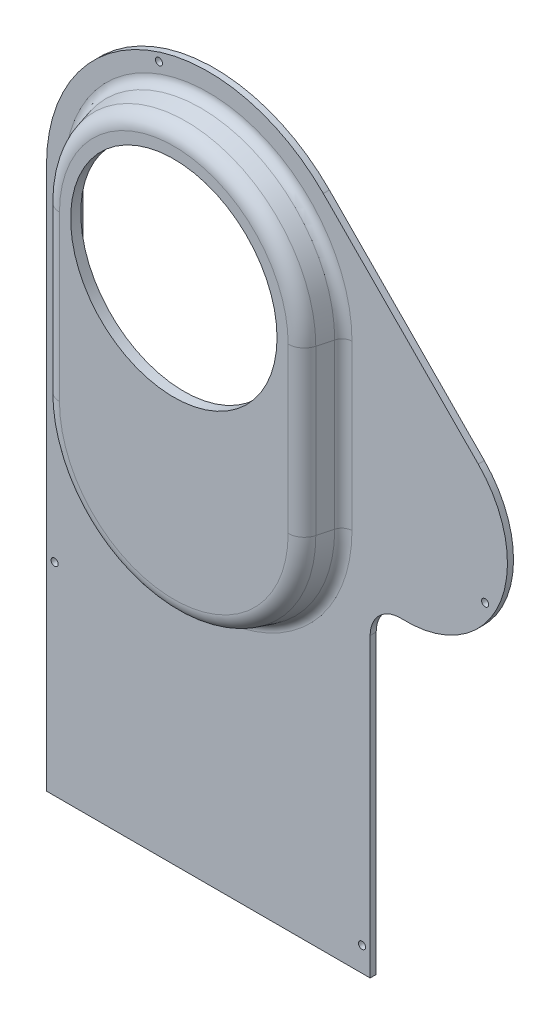
ISO-10303-21;
HEADER;
FILE_DESCRIPTION(('STEP AP214'),'2;1');
FILE_NAME('part.step','',(''),(''),'','','');
FILE_SCHEMA(('AUTOMOTIVE_DESIGN { 1 0 10303 214 1 1 1 1 }'));
ENDSEC;
DATA;
#1=APPLICATION_CONTEXT('core data for automotive mechanical design processes');
#2=APPLICATION_PROTOCOL_DEFINITION('international standard','automotive_design',2000,#1);
#3=PRODUCT_CONTEXT('',#1,'mechanical');
#4=PRODUCT('Part','Part','',(#3));
#5=PRODUCT_RELATED_PRODUCT_CATEGORY('part','',(#4));
#6=PRODUCT_DEFINITION_FORMATION('','',#4);
#7=PRODUCT_DEFINITION_CONTEXT('part definition',#1,'design');
#8=PRODUCT_DEFINITION('design','',#6,#7);
#9=PRODUCT_DEFINITION_SHAPE('','',#8);
#10=(LENGTH_UNIT() NAMED_UNIT(*) SI_UNIT(.MILLI.,.METRE.));
#11=(NAMED_UNIT(*) PLANE_ANGLE_UNIT() SI_UNIT($,.RADIAN.));
#12=(NAMED_UNIT(*) SI_UNIT($,.STERADIAN.) SOLID_ANGLE_UNIT());
#13=UNCERTAINTY_MEASURE_WITH_UNIT(LENGTH_MEASURE(1.E-05),#10,'distance_accuracy_value','');
#14=(GEOMETRIC_REPRESENTATION_CONTEXT(3) GLOBAL_UNCERTAINTY_ASSIGNED_CONTEXT((#13)) GLOBAL_UNIT_ASSIGNED_CONTEXT((#10,
#11,#12)) REPRESENTATION_CONTEXT('',''));
#15=CARTESIAN_POINT('',(0.,0.,0.));
#16=DIRECTION('',(0.,0.,1.));
#17=DIRECTION('',(1.,0.,0.));
#18=AXIS2_PLACEMENT_3D('',#15,#16,#17);
#19=CARTESIAN_POINT('',(10.6567303435174,21.0340968700912,0.));
#20=DIRECTION('',(0.,0.,1.));
#21=DIRECTION('',(1.,0.,0.));
#22=AXIS2_PLACEMENT_3D('',#19,#20,#21);
#23=PLANE('',#22);
#24=CARTESIAN_POINT('',(86.6567303435173,-234.965903129909,0.));
#25=DIRECTION('',(0.,0.,1.));
#26=DIRECTION('',(1.,0.,0.));
#27=AXIS2_PLACEMENT_3D('',#24,#25,#26);
#28=CIRCLE('',#27,1.75);
#29=CARTESIAN_POINT('',(88.4067303435173,-234.965903129909,0.));
#30=VERTEX_POINT('',#29);
#31=EDGE_CURVE('E862',#30,#30,#28,.T.);
#32=ORIENTED_EDGE('',*,*,#31,.T.);
#33=EDGE_LOOP('',(#32));
#34=FACE_BOUND('',#33,.T.);
#35=CARTESIAN_POINT('',(-65.2642696564826,-146.965903129909,0.));
#36=DIRECTION('',(0.,0.,1.));
#37=DIRECTION('',(1.,0.,0.));
#38=AXIS2_PLACEMENT_3D('',#35,#36,#37);
#39=CIRCLE('',#38,1.75);
#40=CARTESIAN_POINT('',(-63.5142696564826,-146.965903129909,0.));
#41=VERTEX_POINT('',#40);
#42=EDGE_CURVE('E856',#41,#41,#39,.T.);
#43=ORIENTED_EDGE('',*,*,#42,.T.);
#44=EDGE_LOOP('',(#43));
#45=FACE_BOUND('',#44,.T.);
#46=CARTESIAN_POINT('',(147.488744141459,-57.965903129909,0.));
#47=DIRECTION('',(0.,0.,1.));
#48=DIRECTION('',(1.,0.,0.));
#49=AXIS2_PLACEMENT_3D('',#46,#47,#48);
#50=CIRCLE('',#49,1.75000000000001);
#51=CARTESIAN_POINT('',(149.238744141459,-57.965903129909,0.));
#52=VERTEX_POINT('',#51);
#53=EDGE_CURVE('E851',#52,#52,#50,.T.);
#54=ORIENTED_EDGE('',*,*,#53,.T.);
#55=EDGE_LOOP('',(#54));
#56=FACE_BOUND('',#55,.T.);
#57=CARTESIAN_POINT('',(-13.6743197776755,93.0340968700912,0.));
#58=DIRECTION('',(0.,0.,1.));
#59=DIRECTION('',(1.,0.,0.));
#60=AXIS2_PLACEMENT_3D('',#57,#58,#59);
#61=CIRCLE('',#60,1.75);
#62=CARTESIAN_POINT('',(-11.9243197776755,93.0340968700912,0.));
#63=VERTEX_POINT('',#62);
#64=EDGE_CURVE('E844',#63,#63,#61,.T.);
#65=ORIENTED_EDGE('',*,*,#64,.T.);
#66=EDGE_LOOP('',(#65));
#67=FACE_BOUND('',#66,.T.);
#68=CARTESIAN_POINT('',(10.6567303435174,21.0340968700912,0.));
#69=DIRECTION('',(0.,0.,1.));
#70=DIRECTION('',(1.,0.,0.));
#71=AXIS2_PLACEMENT_3D('',#68,#69,#70);
#72=CIRCLE('',#71,79.921);
#73=CARTESIAN_POINT('',(67.51781858102,77.1962094144654,0.));
#74=VERTEX_POINT('',#73);
#75=CARTESIAN_POINT('',(-69.2642696564826,21.0340968700912,0.));
#76=VERTEX_POINT('',#75);
#77=EDGE_CURVE('E277',#74,#76,#72,.T.);
#78=ORIENTED_EDGE('',*,*,#77,.F.);
#79=DIRECTION('',(-0.702720343143531,0.711466175817402,0.));
#80=VECTOR('',#79,1.);
#81=CARTESIAN_POINT('',(144.090909762029,-0.329885972732348,0.));
#82=LINE('',#81,#80);
#83=CARTESIAN_POINT('',(144.090909762029,-0.329885972732348,0.));
#84=VERTEX_POINT('',#83);
#85=EDGE_CURVE('E291',#84,#74,#82,.T.);
#86=ORIENTED_EDGE('',*,*,#85,.F.);
#87=CARTESIAN_POINT('',(108.517600971159,-35.4659031299089,0.));
#88=DIRECTION('',(0.,0.,1.));
#89=DIRECTION('',(1.,0.,0.));
#90=AXIS2_PLACEMENT_3D('',#87,#88,#89);
#91=CIRCLE('',#90,50.);
#92=CARTESIAN_POINT('',(106.316931257588,-85.4174501811442,0.));
#93=VERTEX_POINT('',#92);
#94=EDGE_CURVE('E289',#93,#84,#91,.T.);
#95=ORIENTED_EDGE('',*,*,#94,.F.);
#96=CARTESIAN_POINT('',(105.656730343517,-100.402914296515,0.));
#97=DIRECTION('',(0.,0.,-1.));
#98=DIRECTION('',(1.,0.,0.));
#99=AXIS2_PLACEMENT_3D('',#96,#97,#98);
#100=CIRCLE('',#99,15.);
#101=CARTESIAN_POINT('',(90.6567303435173,-100.402914296515,0.));
#102=VERTEX_POINT('',#101);
#103=EDGE_CURVE('E287',#102,#93,#100,.T.);
#104=ORIENTED_EDGE('',*,*,#103,.F.);
#105=DIRECTION('',(0.,1.,0.));
#106=VECTOR('',#105,1.);
#107=CARTESIAN_POINT('',(90.6567303435173,-246.965903129909,0.));
#108=LINE('',#107,#106);
#109=CARTESIAN_POINT('',(90.6567303435173,-246.965903129909,0.));
#110=VERTEX_POINT('',#109);
#111=EDGE_CURVE('E285',#110,#102,#108,.T.);
#112=ORIENTED_EDGE('',*,*,#111,.F.);
#113=DIRECTION('',(1.,0.,0.));
#114=VECTOR('',#113,1.);
#115=CARTESIAN_POINT('',(-69.2642696564826,-246.965903129909,0.));
#116=LINE('',#115,#114);
#117=CARTESIAN_POINT('',(-69.2642696564826,-246.965903129909,0.));
#118=VERTEX_POINT('',#117);
#119=EDGE_CURVE('E283',#118,#110,#116,.T.);
#120=ORIENTED_EDGE('',*,*,#119,.F.);
#121=DIRECTION('',(0.,-1.,0.));
#122=VECTOR('',#121,1.);
#123=CARTESIAN_POINT('',(-69.2642696564826,21.0340968700912,0.));
#124=LINE('',#123,#122);
#125=EDGE_CURVE('E280',#76,#118,#124,.T.);
#126=ORIENTED_EDGE('',*,*,#125,.F.);
#127=EDGE_LOOP('',(#78,#86,#95,#104,#112,#120,#126));
#128=FACE_BOUND('',#127,.T.);
#129=DIRECTION('',(0.,1.,0.));
#130=VECTOR('',#129,1.);
#131=CARTESIAN_POINT('',(-54.3760570190842,21.0340968700912,0.));
#132=LINE('',#131,#130);
#133=CARTESIAN_POINT('',(-54.3760570190842,-59.9659031299088,0.));
#134=VERTEX_POINT('',#133);
#135=CARTESIAN_POINT('',(-54.3760570190842,21.0340968700912,0.));
#136=VERTEX_POINT('',#135);
#137=EDGE_CURVE('E273',#134,#136,#132,.T.);
#138=ORIENTED_EDGE('',*,*,#137,.F.);
#139=CARTESIAN_POINT('',(10.6567303435173,-59.9659031299088,0.));
#140=DIRECTION('',(0.,0.,-1.));
#141=DIRECTION('',(-1.,0.,0.));
#142=AXIS2_PLACEMENT_3D('',#139,#140,#141);
#143=CIRCLE('',#142,65.0327873626014);
#144=CARTESIAN_POINT('',(75.6895177061187,-59.9659031299088,0.));
#145=VERTEX_POINT('',#144);
#146=EDGE_CURVE('E271',#145,#134,#143,.T.);
#147=ORIENTED_EDGE('',*,*,#146,.F.);
#148=DIRECTION('',(0.,-1.,0.));
#149=VECTOR('',#148,1.);
#150=CARTESIAN_POINT('',(75.6895177061187,21.0340968700912,0.));
#151=LINE('',#150,#149);
#152=CARTESIAN_POINT('',(75.6895177061187,21.0340968700912,0.));
#153=VERTEX_POINT('',#152);
#154=EDGE_CURVE('E249',#153,#145,#151,.T.);
#155=ORIENTED_EDGE('',*,*,#154,.F.);
#156=CARTESIAN_POINT('',(10.6567303435173,21.0340968700912,0.));
#157=DIRECTION('',(0.,0.,-1.));
#158=DIRECTION('',(-1.,0.,0.));
#159=AXIS2_PLACEMENT_3D('',#156,#157,#158);
#160=CIRCLE('',#159,65.0327873626014);
#161=EDGE_CURVE('E200',#136,#153,#160,.T.);
#162=ORIENTED_EDGE('',*,*,#161,.F.);
#163=EDGE_LOOP('',(#138,#147,#155,#162));
#164=FACE_BOUND('',#163,.T.);
#165=ADVANCED_FACE('F36',(#34,#45,#56,#67,#128,#164),#23,.F.);
#166=CARTESIAN_POINT('',(10.6567303435174,21.0340968700912,3.));
#167=DIRECTION('',(0.,0.,1.));
#168=DIRECTION('',(1.,0.,0.));
#169=AXIS2_PLACEMENT_3D('',#166,#167,#168);
#170=PLANE('',#169);
#171=CARTESIAN_POINT('',(86.6567303435173,-234.965903129909,3.));
#172=DIRECTION('',(0.,0.,1.));
#173=DIRECTION('',(1.,0.,0.));
#174=AXIS2_PLACEMENT_3D('',#171,#172,#173);
#175=CIRCLE('',#174,1.75);
#176=CARTESIAN_POINT('',(88.4067303435173,-234.965903129909,3.));
#177=VERTEX_POINT('',#176);
#178=EDGE_CURVE('E865',#177,#177,#175,.T.);
#179=ORIENTED_EDGE('',*,*,#178,.F.);
#180=EDGE_LOOP('',(#179));
#181=FACE_BOUND('',#180,.T.);
#182=CARTESIAN_POINT('',(-65.2642696564826,-146.965903129909,3.));
#183=DIRECTION('',(0.,0.,1.));
#184=DIRECTION('',(1.,0.,0.));
#185=AXIS2_PLACEMENT_3D('',#182,#183,#184);
#186=CIRCLE('',#185,1.75);
#187=CARTESIAN_POINT('',(-63.5142696564826,-146.965903129909,3.));
#188=VERTEX_POINT('',#187);
#189=EDGE_CURVE('E859',#188,#188,#186,.T.);
#190=ORIENTED_EDGE('',*,*,#189,.F.);
#191=EDGE_LOOP('',(#190));
#192=FACE_BOUND('',#191,.T.);
#193=CARTESIAN_POINT('',(147.488744141459,-57.965903129909,3.));
#194=DIRECTION('',(0.,0.,1.));
#195=DIRECTION('',(1.,0.,0.));
#196=AXIS2_PLACEMENT_3D('',#193,#194,#195);
#197=CIRCLE('',#196,1.75000000000001);
#198=CARTESIAN_POINT('',(149.238744141459,-57.965903129909,3.));
#199=VERTEX_POINT('',#198);
#200=EDGE_CURVE('E853',#199,#199,#197,.T.);
#201=ORIENTED_EDGE('',*,*,#200,.F.);
#202=EDGE_LOOP('',(#201));
#203=FACE_BOUND('',#202,.T.);
#204=CARTESIAN_POINT('',(-13.6743197776755,93.0340968700912,3.));
#205=DIRECTION('',(0.,0.,1.));
#206=DIRECTION('',(1.,0.,0.));
#207=AXIS2_PLACEMENT_3D('',#204,#205,#206);
#208=CIRCLE('',#207,1.75);
#209=CARTESIAN_POINT('',(-11.9243197776755,93.0340968700912,3.));
#210=VERTEX_POINT('',#209);
#211=EDGE_CURVE('E847',#210,#210,#208,.T.);
#212=ORIENTED_EDGE('',*,*,#211,.F.);
#213=EDGE_LOOP('',(#212));
#214=FACE_BOUND('',#213,.T.);
#215=DIRECTION('',(0.,-1.,0.));
#216=VECTOR('',#215,1.);
#217=CARTESIAN_POINT('',(81.6895177061187,21.0340968700912,3.));
#218=LINE('',#217,#216);
#219=CARTESIAN_POINT('',(81.6895177061187,21.0340968700912,3.));
#220=VERTEX_POINT('',#219);
#221=CARTESIAN_POINT('',(81.6895177061187,-59.9659031299088,3.));
#222=VERTEX_POINT('',#221);
#223=EDGE_CURVE('E344',#220,#222,#218,.T.);
#224=ORIENTED_EDGE('',*,*,#223,.T.);
#225=CARTESIAN_POINT('',(10.6567303435173,-59.9659031299088,3.));
#226=DIRECTION('',(0.,0.,1.));
#227=DIRECTION('',(1.,0.,0.));
#228=AXIS2_PLACEMENT_3D('',#225,#226,#227);
#229=CIRCLE('',#228,71.0327873626015);
#230=CARTESIAN_POINT('',(-60.3760570190841,-59.9659031299088,3.));
#231=VERTEX_POINT('',#230);
#232=EDGE_CURVE('E346',#222,#231,#229,.F.);
#233=ORIENTED_EDGE('',*,*,#232,.T.);
#234=DIRECTION('',(0.,1.,0.));
#235=VECTOR('',#234,1.);
#236=CARTESIAN_POINT('',(-60.3760570190842,21.0340968700912,3.));
#237=LINE('',#236,#235);
#238=CARTESIAN_POINT('',(-60.3760570190842,21.0340968700912,3.));
#239=VERTEX_POINT('',#238);
#240=EDGE_CURVE('E342',#231,#239,#237,.T.);
#241=ORIENTED_EDGE('',*,*,#240,.T.);
#242=CARTESIAN_POINT('',(10.6567303435173,21.0340968700912,3.));
#243=DIRECTION('',(0.,0.,1.));
#244=DIRECTION('',(1.,0.,0.));
#245=AXIS2_PLACEMENT_3D('',#242,#243,#244);
#246=CIRCLE('',#245,71.0327873626014);
#247=EDGE_CURVE('E340',#239,#220,#246,.F.);
#248=ORIENTED_EDGE('',*,*,#247,.T.);
#249=EDGE_LOOP('',(#224,#233,#241,#248));
#250=FACE_BOUND('',#249,.T.);
#251=CARTESIAN_POINT('',(10.6567303435174,21.0340968700912,3.));
#252=DIRECTION('',(0.,0.,1.));
#253=DIRECTION('',(1.,0.,0.));
#254=AXIS2_PLACEMENT_3D('',#251,#252,#253);
#255=CIRCLE('',#254,79.921);
#256=CARTESIAN_POINT('',(67.51781858102,77.1962094144654,3.));
#257=VERTEX_POINT('',#256);
#258=CARTESIAN_POINT('',(-69.2642696564826,21.0340968700912,3.));
#259=VERTEX_POINT('',#258);
#260=EDGE_CURVE('E293',#257,#259,#255,.T.);
#261=ORIENTED_EDGE('',*,*,#260,.T.);
#262=DIRECTION('',(0.,-1.,0.));
#263=VECTOR('',#262,1.);
#264=CARTESIAN_POINT('',(-69.2642696564826,21.0340968700912,3.));
#265=LINE('',#264,#263);
#266=CARTESIAN_POINT('',(-69.2642696564826,-246.965903129909,3.));
#267=VERTEX_POINT('',#266);
#268=EDGE_CURVE('E296',#259,#267,#265,.T.);
#269=ORIENTED_EDGE('',*,*,#268,.T.);
#270=DIRECTION('',(1.,0.,0.));
#271=VECTOR('',#270,1.);
#272=CARTESIAN_POINT('',(-69.2642696564826,-246.965903129909,3.));
#273=LINE('',#272,#271);
#274=CARTESIAN_POINT('',(90.6567303435173,-246.965903129909,3.));
#275=VERTEX_POINT('',#274);
#276=EDGE_CURVE('E298',#267,#275,#273,.T.);
#277=ORIENTED_EDGE('',*,*,#276,.T.);
#278=DIRECTION('',(0.,1.,0.));
#279=VECTOR('',#278,1.);
#280=CARTESIAN_POINT('',(90.6567303435173,-246.965903129909,3.));
#281=LINE('',#280,#279);
#282=CARTESIAN_POINT('',(90.6567303435173,-100.402914296515,3.));
#283=VERTEX_POINT('',#282);
#284=EDGE_CURVE('E300',#275,#283,#281,.T.);
#285=ORIENTED_EDGE('',*,*,#284,.T.);
#286=CARTESIAN_POINT('',(105.656730343517,-100.402914296515,3.));
#287=DIRECTION('',(0.,0.,-1.));
#288=DIRECTION('',(1.,0.,0.));
#289=AXIS2_PLACEMENT_3D('',#286,#287,#288);
#290=CIRCLE('',#289,15.);
#291=CARTESIAN_POINT('',(106.316931257588,-85.4174501811442,3.));
#292=VERTEX_POINT('',#291);
#293=EDGE_CURVE('E302',#283,#292,#290,.T.);
#294=ORIENTED_EDGE('',*,*,#293,.T.);
#295=CARTESIAN_POINT('',(108.517600971159,-35.4659031299089,3.));
#296=DIRECTION('',(0.,0.,1.));
#297=DIRECTION('',(1.,0.,0.));
#298=AXIS2_PLACEMENT_3D('',#295,#296,#297);
#299=CIRCLE('',#298,50.);
#300=CARTESIAN_POINT('',(144.090909762029,-0.329885972732348,3.));
#301=VERTEX_POINT('',#300);
#302=EDGE_CURVE('E304',#292,#301,#299,.T.);
#303=ORIENTED_EDGE('',*,*,#302,.T.);
#304=DIRECTION('',(-0.702720343143531,0.711466175817402,0.));
#305=VECTOR('',#304,1.);
#306=CARTESIAN_POINT('',(144.090909762029,-0.329885972732348,3.));
#307=LINE('',#306,#305);
#308=EDGE_CURVE('E306',#301,#257,#307,.T.);
#309=ORIENTED_EDGE('',*,*,#308,.T.);
#310=EDGE_LOOP('',(#261,#269,#277,#285,#294,#303,#309));
#311=FACE_BOUND('',#310,.T.);
#312=ADVANCED_FACE('F449',(#181,#192,#203,#214,#250,#311),#170,.T.);
#313=CARTESIAN_POINT('',(10.6567303435174,21.0340968700912,3.));
#314=DIRECTION('',(0.,0.,-1.));
#315=DIRECTION('',(-1.,0.,0.));
#316=AXIS2_PLACEMENT_3D('',#313,#314,#315);
#317=CYLINDRICAL_SURFACE('',#316,79.921);
#318=ORIENTED_EDGE('',*,*,#77,.T.);
#319=DIRECTION('',(0.,0.,-1.));
#320=VECTOR('',#319,1.);
#321=CARTESIAN_POINT('',(-69.2642696564826,21.0340968700912,3.));
#322=LINE('',#321,#320);
#323=EDGE_CURVE('E326',#259,#76,#322,.T.);
#324=ORIENTED_EDGE('',*,*,#323,.F.);
#325=ORIENTED_EDGE('',*,*,#260,.F.);
#326=DIRECTION('',(0.,0.,-1.));
#327=VECTOR('',#326,1.);
#328=CARTESIAN_POINT('',(67.51781858102,77.1962094144654,3.));
#329=LINE('',#328,#327);
#330=EDGE_CURVE('E308',#257,#74,#329,.T.);
#331=ORIENTED_EDGE('',*,*,#330,.T.);
#332=EDGE_LOOP('',(#318,#324,#325,#331));
#333=FACE_BOUND('',#332,.T.);
#334=ADVANCED_FACE('F454',(#333),#317,.T.);
#335=CARTESIAN_POINT('',(-69.2642696564826,21.0340968700912,3.));
#336=DIRECTION('',(1.,0.,0.));
#337=DIRECTION('',(0.,1.,0.));
#338=AXIS2_PLACEMENT_3D('',#335,#336,#337);
#339=PLANE('',#338);
#340=ORIENTED_EDGE('',*,*,#125,.T.);
#341=DIRECTION('',(0.,0.,-1.));
#342=VECTOR('',#341,1.);
#343=CARTESIAN_POINT('',(-69.2642696564826,-246.965903129909,3.));
#344=LINE('',#343,#342);
#345=EDGE_CURVE('E323',#267,#118,#344,.T.);
#346=ORIENTED_EDGE('',*,*,#345,.F.);
#347=ORIENTED_EDGE('',*,*,#268,.F.);
#348=ORIENTED_EDGE('',*,*,#323,.T.);
#349=EDGE_LOOP('',(#340,#346,#347,#348));
#350=FACE_BOUND('',#349,.T.);
#351=ADVANCED_FACE('F479',(#350),#339,.F.);
#352=CARTESIAN_POINT('',(-69.2642696564826,-246.965903129909,3.));
#353=DIRECTION('',(0.,1.,0.));
#354=DIRECTION('',(0.,0.,1.));
#355=AXIS2_PLACEMENT_3D('',#352,#353,#354);
#356=PLANE('',#355);
#357=ORIENTED_EDGE('',*,*,#119,.T.);
#358=DIRECTION('',(0.,0.,-1.));
#359=VECTOR('',#358,1.);
#360=CARTESIAN_POINT('',(90.6567303435173,-246.965903129909,3.));
#361=LINE('',#360,#359);
#362=EDGE_CURVE('E320',#275,#110,#361,.T.);
#363=ORIENTED_EDGE('',*,*,#362,.F.);
#364=ORIENTED_EDGE('',*,*,#276,.F.);
#365=ORIENTED_EDGE('',*,*,#345,.T.);
#366=EDGE_LOOP('',(#357,#363,#364,#365));
#367=FACE_BOUND('',#366,.T.);
#368=ADVANCED_FACE('F475',(#367),#356,.F.);
#369=CARTESIAN_POINT('',(90.6567303435173,-246.965903129909,3.));
#370=DIRECTION('',(-1.,0.,0.));
#371=DIRECTION('',(0.,0.,1.));
#372=AXIS2_PLACEMENT_3D('',#369,#370,#371);
#373=PLANE('',#372);
#374=ORIENTED_EDGE('',*,*,#111,.T.);
#375=DIRECTION('',(0.,0.,-1.));
#376=VECTOR('',#375,1.);
#377=CARTESIAN_POINT('',(90.6567303435173,-100.402914296515,3.));
#378=LINE('',#377,#376);
#379=EDGE_CURVE('E317',#283,#102,#378,.T.);
#380=ORIENTED_EDGE('',*,*,#379,.F.);
#381=ORIENTED_EDGE('',*,*,#284,.F.);
#382=ORIENTED_EDGE('',*,*,#362,.T.);
#383=EDGE_LOOP('',(#374,#380,#381,#382));
#384=FACE_BOUND('',#383,.T.);
#385=ADVANCED_FACE('F471',(#384),#373,.F.);
#386=CARTESIAN_POINT('',(105.656730343517,-100.402914296515,3.));
#387=DIRECTION('',(0.,0.,-1.));
#388=DIRECTION('',(-1.,0.,0.));
#389=AXIS2_PLACEMENT_3D('',#386,#387,#388);
#390=CYLINDRICAL_SURFACE('',#389,15.);
#391=ORIENTED_EDGE('',*,*,#103,.T.);
#392=DIRECTION('',(0.,0.,-1.));
#393=VECTOR('',#392,1.);
#394=CARTESIAN_POINT('',(106.316931257588,-85.4174501811442,3.));
#395=LINE('',#394,#393);
#396=EDGE_CURVE('E314',#292,#93,#395,.T.);
#397=ORIENTED_EDGE('',*,*,#396,.F.);
#398=ORIENTED_EDGE('',*,*,#293,.F.);
#399=ORIENTED_EDGE('',*,*,#379,.T.);
#400=EDGE_LOOP('',(#391,#397,#398,#399));
#401=FACE_BOUND('',#400,.T.);
#402=ADVANCED_FACE('F467',(#401),#390,.F.);
#403=CARTESIAN_POINT('',(108.517600971159,-35.4659031299089,3.));
#404=DIRECTION('',(0.,0.,-1.));
#405=DIRECTION('',(-1.,0.,0.));
#406=AXIS2_PLACEMENT_3D('',#403,#404,#405);
#407=CYLINDRICAL_SURFACE('',#406,50.);
#408=ORIENTED_EDGE('',*,*,#94,.T.);
#409=DIRECTION('',(0.,0.,-1.));
#410=VECTOR('',#409,1.);
#411=CARTESIAN_POINT('',(144.090909762029,-0.329885972732348,3.));
#412=LINE('',#411,#410);
#413=EDGE_CURVE('E311',#301,#84,#412,.T.);
#414=ORIENTED_EDGE('',*,*,#413,.F.);
#415=ORIENTED_EDGE('',*,*,#302,.F.);
#416=ORIENTED_EDGE('',*,*,#396,.T.);
#417=EDGE_LOOP('',(#408,#414,#415,#416));
#418=FACE_BOUND('',#417,.T.);
#419=ADVANCED_FACE('F463',(#418),#407,.T.);
#420=CARTESIAN_POINT('',(144.090909762029,-0.329885972732348,3.));
#421=DIRECTION('',(-0.711466175817402,-0.702720343143531,0.));
#422=DIRECTION('',(0.702720343143531,-0.711466175817402,0.));
#423=AXIS2_PLACEMENT_3D('',#420,#421,#422);
#424=PLANE('',#423);
#425=ORIENTED_EDGE('',*,*,#85,.T.);
#426=ORIENTED_EDGE('',*,*,#330,.F.);
#427=ORIENTED_EDGE('',*,*,#308,.F.);
#428=ORIENTED_EDGE('',*,*,#413,.T.);
#429=EDGE_LOOP('',(#425,#426,#427,#428));
#430=FACE_BOUND('',#429,.T.);
#431=ADVANCED_FACE('F460',(#430),#424,.F.);
#432=CARTESIAN_POINT('',(10.6567303435173,-59.9659031299088,0.));
#433=DIRECTION('',(0.,0.,-1.));
#434=DIRECTION('',(1.,0.,0.));
#435=AXIS2_PLACEMENT_3D('',#432,#433,#434);
#436=CONICAL_SURFACE('',#435,68.,0.26179938779915);
#437=DIRECTION('',(0.258819045102521,0.,-0.965925826289068));
#438=VECTOR('',#437,1.);
#439=CARTESIAN_POINT('',(78.6567303435173,-59.9659031299088,0.));
#440=LINE('',#439,#438);
#441=CARTESIAN_POINT('',(74.8865372013757,-59.9659031299088,14.0705523608202));
#442=VERTEX_POINT('',#441);
#443=CARTESIAN_POINT('',(76.8598885746734,-59.9659031299088,6.70590477448739));
#444=VERTEX_POINT('',#443);
#445=EDGE_CURVE('E281',#442,#444,#440,.T.);
#446=ORIENTED_EDGE('',*,*,#445,.F.);
#447=CARTESIAN_POINT('',(10.6567303435173,-59.9659031299088,14.0705523608202));
#448=DIRECTION('',(0.,0.,-1.));
#449=DIRECTION('',(-1.,0.,0.));
#450=AXIS2_PLACEMENT_3D('',#447,#448,#449);
#451=CIRCLE('',#450,64.2298068578584);
#452=CARTESIAN_POINT('',(-53.5730765143411,-59.9659031299088,14.0705523608202));
#453=VERTEX_POINT('',#452);
#454=EDGE_CURVE('E45',#442,#453,#451,.T.);
#455=ORIENTED_EDGE('',*,*,#454,.T.);
#456=DIRECTION('',(-0.258819045102521,0.,-0.965925826289068));
#457=VECTOR('',#456,1.);
#458=CARTESIAN_POINT('',(-57.3432696564827,-59.9659031299088,0.));
#459=LINE('',#458,#457);
#460=CARTESIAN_POINT('',(-55.5464278876388,-59.9659031299088,6.7059047744874));
#461=VERTEX_POINT('',#460);
#462=EDGE_CURVE('E330',#453,#461,#459,.T.);
#463=ORIENTED_EDGE('',*,*,#462,.T.);
#464=CARTESIAN_POINT('',(10.6567303435173,-59.9659031299088,6.70590477448746));
#465=DIRECTION('',(0.,0.,1.));
#466=DIRECTION('',(1.,0.,0.));
#467=AXIS2_PLACEMENT_3D('',#464,#465,#466);
#468=CIRCLE('',#467,66.2031582311561);
#469=EDGE_CURVE('E329',#461,#444,#468,.T.);
#470=ORIENTED_EDGE('',*,*,#469,.T.);
#471=EDGE_LOOP('',(#446,#455,#463,#470));
#472=FACE_BOUND('',#471,.T.);
#473=ADVANCED_FACE('F423',(#472),#436,.T.);
#474=CARTESIAN_POINT('',(78.6567303435172,21.0340968700912,0.));
#475=DIRECTION('',(0.965925826289068,0.,0.258819045102521));
#476=DIRECTION('',(0.258819045102521,0.,-0.965925826289068));
#477=AXIS2_PLACEMENT_3D('',#474,#475,#476);
#478=PLANE('',#477);
#479=DIRECTION('',(0.258819045102521,0.,-0.965925826289068));
#480=VECTOR('',#479,1.);
#481=CARTESIAN_POINT('',(78.6567303435173,21.0340968700912,0.));
#482=LINE('',#481,#480);
#483=CARTESIAN_POINT('',(74.8865372013757,21.0340968700912,14.0705523608202));
#484=VERTEX_POINT('',#483);
#485=CARTESIAN_POINT('',(76.8598885746733,21.0340968700912,6.70590477448739));
#486=VERTEX_POINT('',#485);
#487=EDGE_CURVE('E335',#484,#486,#482,.T.);
#488=ORIENTED_EDGE('',*,*,#487,.F.);
#489=DIRECTION('',(0.,1.,0.));
#490=VECTOR('',#489,1.);
#491=CARTESIAN_POINT('',(74.8865372013757,-59.9659031299088,14.0705523608202));
#492=LINE('',#491,#490);
#493=EDGE_CURVE('E378',#484,#442,#492,.F.);
#494=ORIENTED_EDGE('',*,*,#493,.T.);
#495=ORIENTED_EDGE('',*,*,#445,.T.);
#496=DIRECTION('',(0.,1.,0.));
#497=VECTOR('',#496,1.);
#498=CARTESIAN_POINT('',(76.8598885746733,21.0340968700912,6.70590477448739));
#499=LINE('',#498,#497);
#500=EDGE_CURVE('E349',#444,#486,#499,.T.);
#501=ORIENTED_EDGE('',*,*,#500,.T.);
#502=EDGE_LOOP('',(#488,#494,#495,#501));
#503=FACE_BOUND('',#502,.T.);
#504=ADVANCED_FACE('F425',(#503),#478,.T.);
#505=CARTESIAN_POINT('',(10.6567303435173,21.0340968700912,0.));
#506=DIRECTION('',(0.,0.,-1.));
#507=DIRECTION('',(1.,0.,0.));
#508=AXIS2_PLACEMENT_3D('',#505,#506,#507);
#509=CONICAL_SURFACE('',#508,68.,0.26179938779915);
#510=DIRECTION('',(-0.258819045102521,0.,-0.965925826289068));
#511=VECTOR('',#510,1.);
#512=CARTESIAN_POINT('',(-57.3432696564827,21.0340968700912,0.));
#513=LINE('',#512,#511);
#514=CARTESIAN_POINT('',(-53.5730765143411,21.0340968700912,14.0705523608202));
#515=VERTEX_POINT('',#514);
#516=CARTESIAN_POINT('',(-55.5464278876388,21.0340968700912,6.70590477448739));
#517=VERTEX_POINT('',#516);
#518=EDGE_CURVE('E332',#515,#517,#513,.T.);
#519=ORIENTED_EDGE('',*,*,#518,.F.);
#520=CARTESIAN_POINT('',(10.6567303435173,21.0340968700912,14.0705523608202));
#521=DIRECTION('',(0.,0.,-1.));
#522=DIRECTION('',(-1.,0.,0.));
#523=AXIS2_PLACEMENT_3D('',#520,#521,#522);
#524=CIRCLE('',#523,64.2298068578584);
#525=EDGE_CURVE('E381',#515,#484,#524,.T.);
#526=ORIENTED_EDGE('',*,*,#525,.T.);
#527=ORIENTED_EDGE('',*,*,#487,.T.);
#528=CARTESIAN_POINT('',(10.6567303435173,21.0340968700912,6.70590477448743));
#529=DIRECTION('',(0.,0.,1.));
#530=DIRECTION('',(1.,0.,0.));
#531=AXIS2_PLACEMENT_3D('',#528,#529,#530);
#532=CIRCLE('',#531,66.2031582311561);
#533=EDGE_CURVE('E355',#486,#517,#532,.T.);
#534=ORIENTED_EDGE('',*,*,#533,.T.);
#535=EDGE_LOOP('',(#519,#526,#527,#534));
#536=FACE_BOUND('',#535,.T.);
#537=ADVANCED_FACE('F404',(#536),#509,.T.);
#538=CARTESIAN_POINT('',(-57.3432696564827,21.0340968700912,0.));
#539=DIRECTION('',(-0.965925826289068,0.,0.258819045102521));
#540=DIRECTION('',(0.258819045102521,0.,0.965925826289068));
#541=AXIS2_PLACEMENT_3D('',#538,#539,#540);
#542=PLANE('',#541);
#543=ORIENTED_EDGE('',*,*,#462,.F.);
#544=DIRECTION('',(0.,-1.,0.));
#545=VECTOR('',#544,1.);
#546=CARTESIAN_POINT('',(-53.5730765143411,21.0340968700912,14.0705523608202));
#547=LINE('',#546,#545);
#548=EDGE_CURVE('E11',#453,#515,#547,.F.);
#549=ORIENTED_EDGE('',*,*,#548,.T.);
#550=ORIENTED_EDGE('',*,*,#518,.T.);
#551=DIRECTION('',(0.,-1.,0.));
#552=VECTOR('',#551,1.);
#553=CARTESIAN_POINT('',(-55.5464278876388,21.0340968700912,6.70590477448739));
#554=LINE('',#553,#552);
#555=EDGE_CURVE('E352',#517,#461,#554,.T.);
#556=ORIENTED_EDGE('',*,*,#555,.T.);
#557=EDGE_LOOP('',(#543,#549,#550,#556));
#558=FACE_BOUND('',#557,.T.);
#559=ADVANCED_FACE('F402',(#558),#542,.T.);
#560=CARTESIAN_POINT('',(10.6567303435173,-59.9659031299088,20.));
#561=DIRECTION('',(0.,0.,1.));
#562=DIRECTION('',(1.,0.,0.));
#563=AXIS2_PLACEMENT_3D('',#560,#561,#562);
#564=PLANE('',#563);
#565=CARTESIAN_POINT('',(10.6567303435173,21.0340968700912,20.));
#566=DIRECTION('',(0.,0.,1.));
#567=DIRECTION('',(1.,0.,0.));
#568=AXIS2_PLACEMENT_3D('',#565,#566,#567);
#569=CIRCLE('',#568,51.);
#570=CARTESIAN_POINT('',(61.6567303435172,21.0340968700912,20.));
#571=VERTEX_POINT('',#570);
#572=EDGE_CURVE('E842',#571,#571,#569,.T.);
#573=ORIENTED_EDGE('',*,*,#572,.F.);
#574=EDGE_LOOP('',(#573));
#575=FACE_BOUND('',#574,.T.);
#576=CARTESIAN_POINT('',(10.6567303435173,-59.9659031299088,20.));
#577=DIRECTION('',(0.,0.,1.));
#578=DIRECTION('',(1.,0.,0.));
#579=AXIS2_PLACEMENT_3D('',#576,#577,#578);
#580=CIRCLE('',#579,56.5024002475459);
#581=CARTESIAN_POINT('',(-45.8456699040286,-59.9659031299088,20.));
#582=VERTEX_POINT('',#581);
#583=CARTESIAN_POINT('',(67.1591305910631,-59.9659031299088,20.));
#584=VERTEX_POINT('',#583);
#585=EDGE_CURVE('E371',#582,#584,#580,.T.);
#586=ORIENTED_EDGE('',*,*,#585,.T.);
#587=DIRECTION('',(0.,-1.,0.));
#588=VECTOR('',#587,1.);
#589=CARTESIAN_POINT('',(67.1591305910631,21.0340968700912,20.));
#590=LINE('',#589,#588);
#591=CARTESIAN_POINT('',(67.1591305910631,21.0340968700912,20.));
#592=VERTEX_POINT('',#591);
#593=EDGE_CURVE('E375',#584,#592,#590,.F.);
#594=ORIENTED_EDGE('',*,*,#593,.T.);
#595=CARTESIAN_POINT('',(10.6567303435173,21.0340968700912,20.));
#596=DIRECTION('',(0.,0.,1.));
#597=DIRECTION('',(1.,0.,0.));
#598=AXIS2_PLACEMENT_3D('',#595,#596,#597);
#599=CIRCLE('',#598,56.5024002475458);
#600=CARTESIAN_POINT('',(-45.8456699040286,21.0340968700912,20.));
#601=VERTEX_POINT('',#600);
#602=EDGE_CURVE('E373',#592,#601,#599,.T.);
#603=ORIENTED_EDGE('',*,*,#602,.T.);
#604=DIRECTION('',(0.,1.,0.));
#605=VECTOR('',#604,1.);
#606=CARTESIAN_POINT('',(-45.8456699040286,-59.9659031299088,20.));
#607=LINE('',#606,#605);
#608=EDGE_CURVE('E358',#601,#582,#607,.F.);
#609=ORIENTED_EDGE('',*,*,#608,.T.);
#610=EDGE_LOOP('',(#586,#594,#603,#609));
#611=FACE_BOUND('',#610,.T.);
#612=ADVANCED_FACE('F435',(#575,#611),#564,.T.);
#613=CARTESIAN_POINT('',(10.6567303435173,21.0340968700912,8.));
#614=DIRECTION('',(0.,0.,1.));
#615=DIRECTION('',(1.,0.,0.));
#616=AXIS2_PLACEMENT_3D('',#613,#614,#615);
#617=TOROIDAL_SURFACE('',#616,71.0327873626014,5.);
#618=CARTESIAN_POINT('',(81.6895177061187,21.0340968700912,8.));
#619=DIRECTION('',(0.,1.,0.));
#620=DIRECTION('',(-1.,0.,0.));
#621=AXIS2_PLACEMENT_3D('',#618,#619,#620);
#622=CIRCLE('',#621,5.);
#623=EDGE_CURVE('E365',#220,#486,#622,.T.);
#624=ORIENTED_EDGE('',*,*,#623,.F.);
#625=ORIENTED_EDGE('',*,*,#247,.F.);
#626=CARTESIAN_POINT('',(-60.3760570190842,21.0340968700912,8.));
#627=DIRECTION('',(0.,1.,0.));
#628=DIRECTION('',(0.,0.,1.));
#629=AXIS2_PLACEMENT_3D('',#626,#627,#628);
#630=CIRCLE('',#629,5.);
#631=EDGE_CURVE('E333',#517,#239,#630,.T.);
#632=ORIENTED_EDGE('',*,*,#631,.F.);
#633=ORIENTED_EDGE('',*,*,#533,.F.);
#634=EDGE_LOOP('',(#624,#625,#632,#633));
#635=FACE_BOUND('',#634,.T.);
#636=ADVANCED_FACE('F412',(#635),#617,.F.);
#637=CARTESIAN_POINT('',(-60.3760570190842,21.0340968700912,8.));
#638=DIRECTION('',(0.,1.,0.));
#639=DIRECTION('',(-1.,0.,0.));
#640=AXIS2_PLACEMENT_3D('',#637,#638,#639);
#641=CYLINDRICAL_SURFACE('',#640,5.);
#642=ORIENTED_EDGE('',*,*,#631,.T.);
#643=ORIENTED_EDGE('',*,*,#240,.F.);
#644=CARTESIAN_POINT('',(-60.3760570190841,-59.9659031299088,8.));
#645=DIRECTION('',(0.,1.,0.));
#646=DIRECTION('',(0.,0.,1.));
#647=AXIS2_PLACEMENT_3D('',#644,#645,#646);
#648=CIRCLE('',#647,5.);
#649=EDGE_CURVE('E362',#461,#231,#648,.T.);
#650=ORIENTED_EDGE('',*,*,#649,.F.);
#651=ORIENTED_EDGE('',*,*,#555,.F.);
#652=EDGE_LOOP('',(#642,#643,#650,#651));
#653=FACE_BOUND('',#652,.T.);
#654=ADVANCED_FACE('F416',(#653),#641,.F.);
#655=CARTESIAN_POINT('',(81.6895177061187,21.0340968700912,8.));
#656=DIRECTION('',(0.,-1.,0.));
#657=DIRECTION('',(1.,0.,0.));
#658=AXIS2_PLACEMENT_3D('',#655,#656,#657);
#659=CYLINDRICAL_SURFACE('',#658,5.);
#660=ORIENTED_EDGE('',*,*,#623,.T.);
#661=ORIENTED_EDGE('',*,*,#500,.F.);
#662=CARTESIAN_POINT('',(81.6895177061187,-59.9659031299088,8.));
#663=DIRECTION('',(0.,1.,0.));
#664=DIRECTION('',(0.,0.,1.));
#665=AXIS2_PLACEMENT_3D('',#662,#663,#664);
#666=CIRCLE('',#665,5.);
#667=EDGE_CURVE('E359',#222,#444,#666,.T.);
#668=ORIENTED_EDGE('',*,*,#667,.F.);
#669=ORIENTED_EDGE('',*,*,#223,.F.);
#670=EDGE_LOOP('',(#660,#661,#668,#669));
#671=FACE_BOUND('',#670,.T.);
#672=ADVANCED_FACE('F495',(#671),#659,.F.);
#673=CARTESIAN_POINT('',(10.6567303435173,-59.9659031299088,8.));
#674=DIRECTION('',(0.,0.,1.));
#675=DIRECTION('',(1.,0.,0.));
#676=AXIS2_PLACEMENT_3D('',#673,#674,#675);
#677=TOROIDAL_SURFACE('',#676,71.0327873626015,5.);
#678=ORIENTED_EDGE('',*,*,#649,.T.);
#679=ORIENTED_EDGE('',*,*,#232,.F.);
#680=ORIENTED_EDGE('',*,*,#667,.T.);
#681=ORIENTED_EDGE('',*,*,#469,.F.);
#682=EDGE_LOOP('',(#678,#679,#680,#681));
#683=FACE_BOUND('',#682,.T.);
#684=ADVANCED_FACE('F420',(#683),#677,.F.);
#685=CARTESIAN_POINT('',(-45.8456699040286,-59.9659031299088,12.));
#686=DIRECTION('',(0.,-1.,0.));
#687=DIRECTION('',(1.,0.,0.));
#688=AXIS2_PLACEMENT_3D('',#685,#686,#687);
#689=CYLINDRICAL_SURFACE('',#688,8.);
#690=CARTESIAN_POINT('',(-45.8456699040286,21.0340968700912,12.));
#691=DIRECTION('',(0.,1.,0.));
#692=DIRECTION('',(0.,0.,1.));
#693=AXIS2_PLACEMENT_3D('',#690,#691,#692);
#694=CIRCLE('',#693,8.);
#695=EDGE_CURVE('E387',#515,#601,#694,.T.);
#696=ORIENTED_EDGE('',*,*,#695,.F.);
#697=ORIENTED_EDGE('',*,*,#548,.F.);
#698=CARTESIAN_POINT('',(-45.8456699040286,-59.9659031299088,12.));
#699=DIRECTION('',(0.,-1.,0.));
#700=DIRECTION('',(0.,0.,-1.));
#701=AXIS2_PLACEMENT_3D('',#698,#699,#700);
#702=CIRCLE('',#701,8.);
#703=EDGE_CURVE('E363',#582,#453,#702,.T.);
#704=ORIENTED_EDGE('',*,*,#703,.F.);
#705=ORIENTED_EDGE('',*,*,#608,.F.);
#706=EDGE_LOOP('',(#696,#697,#704,#705));
#707=FACE_BOUND('',#706,.T.);
#708=ADVANCED_FACE('F38',(#707),#689,.T.);
#709=CARTESIAN_POINT('',(10.6567303435173,-59.9659031299088,12.));
#710=DIRECTION('',(0.,0.,1.));
#711=DIRECTION('',(1.,0.,0.));
#712=AXIS2_PLACEMENT_3D('',#709,#710,#711);
#713=TOROIDAL_SURFACE('',#712,56.5024002475459,8.);
#714=ORIENTED_EDGE('',*,*,#703,.T.);
#715=ORIENTED_EDGE('',*,*,#454,.F.);
#716=CARTESIAN_POINT('',(67.1591305910631,-59.9659031299088,12.));
#717=DIRECTION('',(0.,1.,0.));
#718=DIRECTION('',(-1.,0.,0.));
#719=AXIS2_PLACEMENT_3D('',#716,#717,#718);
#720=CIRCLE('',#719,8.);
#721=EDGE_CURVE('E385',#584,#442,#720,.T.);
#722=ORIENTED_EDGE('',*,*,#721,.F.);
#723=ORIENTED_EDGE('',*,*,#585,.F.);
#724=EDGE_LOOP('',(#714,#715,#722,#723));
#725=FACE_BOUND('',#724,.T.);
#726=ADVANCED_FACE('F393',(#725),#713,.T.);
#727=CARTESIAN_POINT('',(10.6567303435173,21.0340968700912,12.));
#728=DIRECTION('',(0.,0.,1.));
#729=DIRECTION('',(1.,0.,0.));
#730=AXIS2_PLACEMENT_3D('',#727,#728,#729);
#731=TOROIDAL_SURFACE('',#730,56.5024002475458,8.);
#732=ORIENTED_EDGE('',*,*,#695,.T.);
#733=ORIENTED_EDGE('',*,*,#602,.F.);
#734=CARTESIAN_POINT('',(67.1591305910631,21.0340968700912,12.));
#735=DIRECTION('',(0.,-1.,0.));
#736=DIRECTION('',(0.,0.,-1.));
#737=AXIS2_PLACEMENT_3D('',#734,#735,#736);
#738=CIRCLE('',#737,8.);
#739=EDGE_CURVE('E276',#484,#592,#738,.T.);
#740=ORIENTED_EDGE('',*,*,#739,.F.);
#741=ORIENTED_EDGE('',*,*,#525,.F.);
#742=EDGE_LOOP('',(#732,#733,#740,#741));
#743=FACE_BOUND('',#742,.T.);
#744=ADVANCED_FACE('F433',(#743),#731,.T.);
#745=CARTESIAN_POINT('',(67.1591305910631,-59.9659031299088,12.));
#746=DIRECTION('',(0.,1.,0.));
#747=DIRECTION('',(-1.,0.,0.));
#748=AXIS2_PLACEMENT_3D('',#745,#746,#747);
#749=CYLINDRICAL_SURFACE('',#748,8.);
#750=ORIENTED_EDGE('',*,*,#721,.T.);
#751=ORIENTED_EDGE('',*,*,#493,.F.);
#752=ORIENTED_EDGE('',*,*,#739,.T.);
#753=ORIENTED_EDGE('',*,*,#593,.F.);
#754=EDGE_LOOP('',(#750,#751,#752,#753));
#755=FACE_BOUND('',#754,.T.);
#756=ADVANCED_FACE('F429',(#755),#749,.T.);
#757=CARTESIAN_POINT('',(10.6567303435173,-59.9659031299088,-1.29409522551261));
#758=DIRECTION('',(0.,0.,-1.));
#759=DIRECTION('',(1.,0.,0.));
#760=AXIS2_PLACEMENT_3D('',#757,#758,#759);
#761=CONICAL_SURFACE('',#760,63.1703708685547,0.26179938779915);
#762=DIRECTION('',(0.258819045102521,0.,-0.965925826289068));
#763=VECTOR('',#762,1.);
#764=CARTESIAN_POINT('',(73.8271012120719,-59.9659031299088,-1.2940952255126));
#765=LINE('',#764,#763);
#766=CARTESIAN_POINT('',(70.0569080699303,-59.9659031299088,12.7764571353076));
#767=VERTEX_POINT('',#766);
#768=CARTESIAN_POINT('',(72.030259443228,-59.9659031299088,5.41180954897479));
#769=VERTEX_POINT('',#768);
#770=EDGE_CURVE('E220',#767,#769,#765,.T.);
#771=ORIENTED_EDGE('',*,*,#770,.T.);
#772=CARTESIAN_POINT('',(10.6567303435173,-59.9659031299088,5.41180954897479));
#773=DIRECTION('',(0.,0.,-1.));
#774=DIRECTION('',(-1.,0.,0.));
#775=AXIS2_PLACEMENT_3D('',#772,#773,#774);
#776=CIRCLE('',#775,61.3735290997108);
#777=CARTESIAN_POINT('',(-50.7167987561935,-59.9659031299088,5.41180954897481));
#778=VERTEX_POINT('',#777);
#779=EDGE_CURVE('E226',#778,#769,#776,.F.);
#780=ORIENTED_EDGE('',*,*,#779,.F.);
#781=DIRECTION('',(-0.258819045102521,0.,-0.965925826289068));
#782=VECTOR('',#781,1.);
#783=CARTESIAN_POINT('',(-52.5136405250374,-59.9659031299088,-1.29409522551261));
#784=LINE('',#783,#782);
#785=CARTESIAN_POINT('',(-48.7434473828958,-59.9659031299088,12.7764571353076));
#786=VERTEX_POINT('',#785);
#787=EDGE_CURVE('E245',#786,#778,#784,.T.);
#788=ORIENTED_EDGE('',*,*,#787,.F.);
#789=CARTESIAN_POINT('',(10.6567303435173,-59.9659031299088,12.7764571353076));
#790=DIRECTION('',(0.,0.,-1.));
#791=DIRECTION('',(-1.,0.,0.));
#792=AXIS2_PLACEMENT_3D('',#789,#790,#791);
#793=CIRCLE('',#792,59.4001777264131);
#794=EDGE_CURVE('E242',#767,#786,#793,.T.);
#795=ORIENTED_EDGE('',*,*,#794,.F.);
#796=EDGE_LOOP('',(#771,#780,#788,#795));
#797=FACE_BOUND('',#796,.T.);
#798=ADVANCED_FACE('F503',(#797),#761,.F.);
#799=CARTESIAN_POINT('',(73.8271012120719,21.0340968700912,-1.29409522551261));
#800=DIRECTION('',(0.965925826289068,0.,0.258819045102521));
#801=DIRECTION('',(0.258819045102521,0.,-0.965925826289068));
#802=AXIS2_PLACEMENT_3D('',#799,#800,#801);
#803=PLANE('',#802);
#804=DIRECTION('',(0.258819045102521,0.,-0.965925826289068));
#805=VECTOR('',#804,1.);
#806=CARTESIAN_POINT('',(73.8271012120719,21.0340968700912,-1.29409522551261));
#807=LINE('',#806,#805);
#808=CARTESIAN_POINT('',(70.0569080699303,21.0340968700912,12.7764571353076));
#809=VERTEX_POINT('',#808);
#810=CARTESIAN_POINT('',(72.030259443228,21.0340968700912,5.41180954897479));
#811=VERTEX_POINT('',#810);
#812=EDGE_CURVE('E211',#809,#811,#807,.T.);
#813=ORIENTED_EDGE('',*,*,#812,.T.);
#814=DIRECTION('',(0.,1.,0.));
#815=VECTOR('',#814,1.);
#816=CARTESIAN_POINT('',(72.030259443228,21.0340968700912,5.41180954897478));
#817=LINE('',#816,#815);
#818=EDGE_CURVE('E214',#769,#811,#817,.T.);
#819=ORIENTED_EDGE('',*,*,#818,.F.);
#820=ORIENTED_EDGE('',*,*,#770,.F.);
#821=DIRECTION('',(0.,1.,0.));
#822=VECTOR('',#821,1.);
#823=CARTESIAN_POINT('',(70.0569080699303,21.0340968700912,12.7764571353076));
#824=LINE('',#823,#822);
#825=EDGE_CURVE('E216',#809,#767,#824,.F.);
#826=ORIENTED_EDGE('',*,*,#825,.F.);
#827=EDGE_LOOP('',(#813,#819,#820,#826));
#828=FACE_BOUND('',#827,.T.);
#829=ADVANCED_FACE('F212',(#828),#803,.F.);
#830=CARTESIAN_POINT('',(10.6567303435173,21.0340968700912,-1.29409522551261));
#831=DIRECTION('',(0.,0.,-1.));
#832=DIRECTION('',(1.,0.,0.));
#833=AXIS2_PLACEMENT_3D('',#830,#831,#832);
#834=CONICAL_SURFACE('',#833,63.1703708685546,0.26179938779915);
#835=DIRECTION('',(0.258819045102521,0.,0.965925826289068));
#836=VECTOR('',#835,1.);
#837=CARTESIAN_POINT('',(-52.5136405250374,21.0340968700912,-1.29409522551261));
#838=LINE('',#837,#836);
#839=CARTESIAN_POINT('',(-48.7434473828958,21.0340968700912,12.7764571353076));
#840=VERTEX_POINT('',#839);
#841=CARTESIAN_POINT('',(-50.7167987561935,21.0340968700912,5.41180954897478));
#842=VERTEX_POINT('',#841);
#843=EDGE_CURVE('E221',#840,#842,#838,.F.);
#844=ORIENTED_EDGE('',*,*,#843,.T.);
#845=CARTESIAN_POINT('',(10.6567303435173,21.0340968700912,5.41180954897478));
#846=DIRECTION('',(0.,0.,-1.));
#847=DIRECTION('',(-1.,0.,0.));
#848=AXIS2_PLACEMENT_3D('',#845,#846,#847);
#849=CIRCLE('',#848,61.3735290997107);
#850=EDGE_CURVE('E197',#811,#842,#849,.F.);
#851=ORIENTED_EDGE('',*,*,#850,.F.);
#852=ORIENTED_EDGE('',*,*,#812,.F.);
#853=CARTESIAN_POINT('',(10.6567303435173,21.0340968700912,12.7764571353076));
#854=DIRECTION('',(0.,0.,-1.));
#855=DIRECTION('',(-1.,0.,0.));
#856=AXIS2_PLACEMENT_3D('',#853,#854,#855);
#857=CIRCLE('',#856,59.400177726413);
#858=EDGE_CURVE('E239',#840,#809,#857,.T.);
#859=ORIENTED_EDGE('',*,*,#858,.F.);
#860=EDGE_LOOP('',(#844,#851,#852,#859));
#861=FACE_BOUND('',#860,.T.);
#862=ADVANCED_FACE('F228',(#861),#834,.F.);
#863=CARTESIAN_POINT('',(-52.5136405250374,21.0340968700912,-1.29409522551261));
#864=DIRECTION('',(-0.965925826289068,0.,0.258819045102521));
#865=DIRECTION('',(0.258819045102521,0.,0.965925826289068));
#866=AXIS2_PLACEMENT_3D('',#863,#864,#865);
#867=PLANE('',#866);
#868=ORIENTED_EDGE('',*,*,#787,.T.);
#869=DIRECTION('',(0.,1.,0.));
#870=VECTOR('',#869,1.);
#871=CARTESIAN_POINT('',(-50.7167987561935,21.0340968700912,5.41180954897478));
#872=LINE('',#871,#870);
#873=EDGE_CURVE('E225',#842,#778,#872,.F.);
#874=ORIENTED_EDGE('',*,*,#873,.F.);
#875=ORIENTED_EDGE('',*,*,#843,.F.);
#876=DIRECTION('',(0.,1.,0.));
#877=VECTOR('',#876,1.);
#878=CARTESIAN_POINT('',(-48.7434473828958,21.0340968700912,12.7764571353076));
#879=LINE('',#878,#877);
#880=EDGE_CURVE('E244',#786,#840,#879,.T.);
#881=ORIENTED_EDGE('',*,*,#880,.F.);
#882=EDGE_LOOP('',(#868,#874,#875,#881));
#883=FACE_BOUND('',#882,.T.);
#884=ADVANCED_FACE('F643',(#883),#867,.F.);
#885=CARTESIAN_POINT('',(10.6567303435173,-59.9659031299088,15.));
#886=DIRECTION('',(0.,0.,1.));
#887=DIRECTION('',(1.,0.,0.));
#888=AXIS2_PLACEMENT_3D('',#885,#886,#887);
#889=PLANE('',#888);
#890=CARTESIAN_POINT('',(10.6567303435173,21.0340968700912,15.));
#891=DIRECTION('',(0.,0.,1.));
#892=DIRECTION('',(1.,0.,0.));
#893=AXIS2_PLACEMENT_3D('',#890,#891,#892);
#894=CIRCLE('',#893,51.);
#895=CARTESIAN_POINT('',(61.6567303435172,21.0340968700912,15.));
#896=VERTEX_POINT('',#895);
#897=EDGE_CURVE('E40',#896,#896,#894,.T.);
#898=ORIENTED_EDGE('',*,*,#897,.T.);
#899=EDGE_LOOP('',(#898));
#900=FACE_BOUND('',#899,.T.);
#901=CARTESIAN_POINT('',(10.6567303435173,-59.9659031299088,15.));
#902=DIRECTION('',(0.,0.,1.));
#903=DIRECTION('',(1.,0.,0.));
#904=AXIS2_PLACEMENT_3D('',#901,#902,#903);
#905=CIRCLE('',#904,56.5024002475459);
#906=CARTESIAN_POINT('',(-45.8456699040286,-59.9659031299088,15.));
#907=VERTEX_POINT('',#906);
#908=CARTESIAN_POINT('',(67.1591305910631,-59.9659031299088,15.));
#909=VERTEX_POINT('',#908);
#910=EDGE_CURVE('E232',#907,#909,#905,.T.);
#911=ORIENTED_EDGE('',*,*,#910,.F.);
#912=DIRECTION('',(0.,1.,0.));
#913=VECTOR('',#912,1.);
#914=CARTESIAN_POINT('',(-45.8456699040286,-59.9659031299088,15.));
#915=LINE('',#914,#913);
#916=CARTESIAN_POINT('',(-45.8456699040286,21.0340968700912,15.));
#917=VERTEX_POINT('',#916);
#918=EDGE_CURVE('E230',#917,#907,#915,.F.);
#919=ORIENTED_EDGE('',*,*,#918,.F.);
#920=CARTESIAN_POINT('',(10.6567303435173,21.0340968700912,15.));
#921=DIRECTION('',(0.,0.,1.));
#922=DIRECTION('',(1.,0.,0.));
#923=AXIS2_PLACEMENT_3D('',#920,#921,#922);
#924=CIRCLE('',#923,56.5024002475458);
#925=CARTESIAN_POINT('',(67.1591305910631,21.0340968700912,15.));
#926=VERTEX_POINT('',#925);
#927=EDGE_CURVE('E263',#926,#917,#924,.T.);
#928=ORIENTED_EDGE('',*,*,#927,.F.);
#929=DIRECTION('',(0.,1.,0.));
#930=VECTOR('',#929,1.);
#931=CARTESIAN_POINT('',(67.1591305910631,-59.9659031299088,15.));
#932=LINE('',#931,#930);
#933=EDGE_CURVE('E240',#909,#926,#932,.T.);
#934=ORIENTED_EDGE('',*,*,#933,.F.);
#935=EDGE_LOOP('',(#911,#919,#928,#934));
#936=FACE_BOUND('',#935,.T.);
#937=ADVANCED_FACE('F646',(#900,#936),#889,.F.);
#938=CARTESIAN_POINT('',(10.6567303435173,21.0340968700912,8.));
#939=DIRECTION('',(0.,0.,1.));
#940=DIRECTION('',(1.,0.,0.));
#941=AXIS2_PLACEMENT_3D('',#938,#939,#940);
#942=TOROIDAL_SURFACE('',#941,71.0327873626014,10.);
#943=ORIENTED_EDGE('',*,*,#161,.T.);
#944=CARTESIAN_POINT('',(81.6895177061187,21.0340968700912,8.));
#945=DIRECTION('',(0.,-1.,0.));
#946=DIRECTION('',(1.,0.,0.));
#947=AXIS2_PLACEMENT_3D('',#944,#945,#946);
#948=CIRCLE('',#947,10.);
#949=EDGE_CURVE('E192',#153,#811,#948,.F.);
#950=ORIENTED_EDGE('',*,*,#949,.T.);
#951=ORIENTED_EDGE('',*,*,#850,.T.);
#952=CARTESIAN_POINT('',(-60.3760570190842,21.0340968700912,8.));
#953=DIRECTION('',(0.,1.,0.));
#954=DIRECTION('',(-1.,0.,0.));
#955=AXIS2_PLACEMENT_3D('',#952,#953,#954);
#956=CIRCLE('',#955,10.);
#957=EDGE_CURVE('E204',#842,#136,#956,.T.);
#958=ORIENTED_EDGE('',*,*,#957,.T.);
#959=EDGE_LOOP('',(#943,#950,#951,#958));
#960=FACE_BOUND('',#959,.T.);
#961=ADVANCED_FACE('F194',(#960),#942,.T.);
#962=CARTESIAN_POINT('',(-60.3760570190842,21.0340968700912,8.));
#963=DIRECTION('',(0.,1.,0.));
#964=DIRECTION('',(-1.,0.,0.));
#965=AXIS2_PLACEMENT_3D('',#962,#963,#964);
#966=CYLINDRICAL_SURFACE('',#965,10.);
#967=ORIENTED_EDGE('',*,*,#137,.T.);
#968=ORIENTED_EDGE('',*,*,#957,.F.);
#969=ORIENTED_EDGE('',*,*,#873,.T.);
#970=CARTESIAN_POINT('',(-60.3760570190842,-59.9659031299088,8.));
#971=DIRECTION('',(0.,1.,0.));
#972=DIRECTION('',(-1.,0.,0.));
#973=AXIS2_PLACEMENT_3D('',#970,#971,#972);
#974=CIRCLE('',#973,10.);
#975=EDGE_CURVE('E205',#778,#134,#974,.T.);
#976=ORIENTED_EDGE('',*,*,#975,.T.);
#977=EDGE_LOOP('',(#967,#968,#969,#976));
#978=FACE_BOUND('',#977,.T.);
#979=ADVANCED_FACE('F653',(#978),#966,.T.);
#980=CARTESIAN_POINT('',(81.6895177061187,21.0340968700912,8.));
#981=DIRECTION('',(0.,-1.,0.));
#982=DIRECTION('',(1.,0.,0.));
#983=AXIS2_PLACEMENT_3D('',#980,#981,#982);
#984=CYLINDRICAL_SURFACE('',#983,10.);
#985=ORIENTED_EDGE('',*,*,#154,.T.);
#986=CARTESIAN_POINT('',(81.6895177061187,-59.9659031299088,8.));
#987=DIRECTION('',(0.,-1.,0.));
#988=DIRECTION('',(1.,0.,0.));
#989=AXIS2_PLACEMENT_3D('',#986,#987,#988);
#990=CIRCLE('',#989,10.);
#991=EDGE_CURVE('E53',#145,#769,#990,.F.);
#992=ORIENTED_EDGE('',*,*,#991,.T.);
#993=ORIENTED_EDGE('',*,*,#818,.T.);
#994=ORIENTED_EDGE('',*,*,#949,.F.);
#995=EDGE_LOOP('',(#985,#992,#993,#994));
#996=FACE_BOUND('',#995,.T.);
#997=ADVANCED_FACE('F223',(#996),#984,.T.);
#998=CARTESIAN_POINT('',(10.6567303435173,-59.9659031299088,8.));
#999=DIRECTION('',(0.,0.,1.));
#1000=DIRECTION('',(1.,0.,0.));
#1001=AXIS2_PLACEMENT_3D('',#998,#999,#1000);
#1002=TOROIDAL_SURFACE('',#1001,71.0327873626015,10.);
#1003=ORIENTED_EDGE('',*,*,#146,.T.);
#1004=ORIENTED_EDGE('',*,*,#975,.F.);
#1005=ORIENTED_EDGE('',*,*,#779,.T.);
#1006=ORIENTED_EDGE('',*,*,#991,.F.);
#1007=EDGE_LOOP('',(#1003,#1004,#1005,#1006));
#1008=FACE_BOUND('',#1007,.T.);
#1009=ADVANCED_FACE('F659',(#1008),#1002,.T.);
#1010=CARTESIAN_POINT('',(-45.8456699040286,-59.9659031299088,12.));
#1011=DIRECTION('',(0.,-1.,0.));
#1012=DIRECTION('',(1.,0.,0.));
#1013=AXIS2_PLACEMENT_3D('',#1010,#1011,#1012);
#1014=CYLINDRICAL_SURFACE('',#1013,3.);
#1015=CARTESIAN_POINT('',(-45.8456699040286,21.0340968700912,12.));
#1016=DIRECTION('',(0.,1.,0.));
#1017=DIRECTION('',(-1.,0.,0.));
#1018=AXIS2_PLACEMENT_3D('',#1015,#1016,#1017);
#1019=CIRCLE('',#1018,3.);
#1020=EDGE_CURVE('E256',#840,#917,#1019,.T.);
#1021=ORIENTED_EDGE('',*,*,#1020,.T.);
#1022=ORIENTED_EDGE('',*,*,#918,.T.);
#1023=CARTESIAN_POINT('',(-45.8456699040286,-59.9659031299088,12.));
#1024=DIRECTION('',(0.,1.,0.));
#1025=DIRECTION('',(-1.,0.,0.));
#1026=AXIS2_PLACEMENT_3D('',#1023,#1024,#1025);
#1027=CIRCLE('',#1026,3.);
#1028=EDGE_CURVE('E255',#907,#786,#1027,.F.);
#1029=ORIENTED_EDGE('',*,*,#1028,.T.);
#1030=ORIENTED_EDGE('',*,*,#880,.T.);
#1031=EDGE_LOOP('',(#1021,#1022,#1029,#1030));
#1032=FACE_BOUND('',#1031,.T.);
#1033=ADVANCED_FACE('F662',(#1032),#1014,.F.);
#1034=CARTESIAN_POINT('',(10.6567303435173,-59.9659031299088,12.));
#1035=DIRECTION('',(0.,0.,1.));
#1036=DIRECTION('',(1.,0.,0.));
#1037=AXIS2_PLACEMENT_3D('',#1034,#1035,#1036);
#1038=TOROIDAL_SURFACE('',#1037,56.5024002475459,3.);
#1039=ORIENTED_EDGE('',*,*,#1028,.F.);
#1040=ORIENTED_EDGE('',*,*,#910,.T.);
#1041=CARTESIAN_POINT('',(67.1591305910631,-59.9659031299088,12.));
#1042=DIRECTION('',(0.,1.,0.));
#1043=DIRECTION('',(-1.,0.,0.));
#1044=AXIS2_PLACEMENT_3D('',#1041,#1042,#1043);
#1045=CIRCLE('',#1044,3.);
#1046=EDGE_CURVE('E259',#909,#767,#1045,.T.);
#1047=ORIENTED_EDGE('',*,*,#1046,.T.);
#1048=ORIENTED_EDGE('',*,*,#794,.T.);
#1049=EDGE_LOOP('',(#1039,#1040,#1047,#1048));
#1050=FACE_BOUND('',#1049,.T.);
#1051=ADVANCED_FACE('F665',(#1050),#1038,.F.);
#1052=CARTESIAN_POINT('',(10.6567303435173,21.0340968700912,12.));
#1053=DIRECTION('',(0.,0.,1.));
#1054=DIRECTION('',(1.,0.,0.));
#1055=AXIS2_PLACEMENT_3D('',#1052,#1053,#1054);
#1056=TOROIDAL_SURFACE('',#1055,56.5024002475458,3.);
#1057=ORIENTED_EDGE('',*,*,#1020,.F.);
#1058=ORIENTED_EDGE('',*,*,#858,.T.);
#1059=CARTESIAN_POINT('',(67.1591305910631,21.0340968700912,12.));
#1060=DIRECTION('',(0.,1.,0.));
#1061=DIRECTION('',(-1.,0.,0.));
#1062=AXIS2_PLACEMENT_3D('',#1059,#1060,#1061);
#1063=CIRCLE('',#1062,3.);
#1064=EDGE_CURVE('E268',#809,#926,#1063,.F.);
#1065=ORIENTED_EDGE('',*,*,#1064,.T.);
#1066=ORIENTED_EDGE('',*,*,#927,.T.);
#1067=EDGE_LOOP('',(#1057,#1058,#1065,#1066));
#1068=FACE_BOUND('',#1067,.T.);
#1069=ADVANCED_FACE('F669',(#1068),#1056,.F.);
#1070=CARTESIAN_POINT('',(67.1591305910631,-59.9659031299088,12.));
#1071=DIRECTION('',(0.,1.,0.));
#1072=DIRECTION('',(-1.,0.,0.));
#1073=AXIS2_PLACEMENT_3D('',#1070,#1071,#1072);
#1074=CYLINDRICAL_SURFACE('',#1073,3.);
#1075=ORIENTED_EDGE('',*,*,#1046,.F.);
#1076=ORIENTED_EDGE('',*,*,#933,.T.);
#1077=ORIENTED_EDGE('',*,*,#1064,.F.);
#1078=ORIENTED_EDGE('',*,*,#825,.T.);
#1079=EDGE_LOOP('',(#1075,#1076,#1077,#1078));
#1080=FACE_BOUND('',#1079,.T.);
#1081=ADVANCED_FACE('F634',(#1080),#1074,.F.);
#1082=CARTESIAN_POINT('',(10.6567303435173,21.0340968700912,0.));
#1083=DIRECTION('',(0.,0.,1.));
#1084=DIRECTION('',(1.,0.,0.));
#1085=AXIS2_PLACEMENT_3D('',#1082,#1083,#1084);
#1086=CYLINDRICAL_SURFACE('',#1085,51.);
#1087=ORIENTED_EDGE('',*,*,#572,.T.);
#1088=EDGE_LOOP('',(#1087));
#1089=FACE_BOUND('',#1088,.T.);
#1090=ORIENTED_EDGE('',*,*,#897,.F.);
#1091=EDGE_LOOP('',(#1090));
#1092=FACE_BOUND('',#1091,.T.);
#1093=ADVANCED_FACE('F594',(#1089,#1092),#1086,.F.);
#1094=CARTESIAN_POINT('',(-13.6743197776755,93.0340968700912,0.));
#1095=DIRECTION('',(0.,0.,1.));
#1096=DIRECTION('',(1.,0.,0.));
#1097=AXIS2_PLACEMENT_3D('',#1094,#1095,#1096);
#1098=CYLINDRICAL_SURFACE('',#1097,1.75);
#1099=ORIENTED_EDGE('',*,*,#64,.F.);
#1100=EDGE_LOOP('',(#1099));
#1101=FACE_BOUND('',#1100,.T.);
#1102=ORIENTED_EDGE('',*,*,#211,.T.);
#1103=EDGE_LOOP('',(#1102));
#1104=FACE_BOUND('',#1103,.T.);
#1105=ADVANCED_FACE('F588',(#1101,#1104),#1098,.F.);
#1106=CARTESIAN_POINT('',(147.488744141459,-57.965903129909,0.));
#1107=DIRECTION('',(0.,0.,1.));
#1108=DIRECTION('',(1.,0.,0.));
#1109=AXIS2_PLACEMENT_3D('',#1106,#1107,#1108);
#1110=CYLINDRICAL_SURFACE('',#1109,1.75000000000001);
#1111=ORIENTED_EDGE('',*,*,#53,.F.);
#1112=EDGE_LOOP('',(#1111));
#1113=FACE_BOUND('',#1112,.T.);
#1114=ORIENTED_EDGE('',*,*,#200,.T.);
#1115=EDGE_LOOP('',(#1114));
#1116=FACE_BOUND('',#1115,.T.);
#1117=ADVANCED_FACE('F593',(#1113,#1116),#1110,.F.);
#1118=CARTESIAN_POINT('',(-65.2642696564826,-146.965903129909,0.));
#1119=DIRECTION('',(0.,0.,1.));
#1120=DIRECTION('',(1.,0.,0.));
#1121=AXIS2_PLACEMENT_3D('',#1118,#1119,#1120);
#1122=CYLINDRICAL_SURFACE('',#1121,1.75);
#1123=ORIENTED_EDGE('',*,*,#42,.F.);
#1124=EDGE_LOOP('',(#1123));
#1125=FACE_BOUND('',#1124,.T.);
#1126=ORIENTED_EDGE('',*,*,#189,.T.);
#1127=EDGE_LOOP('',(#1126));
#1128=FACE_BOUND('',#1127,.T.);
#1129=ADVANCED_FACE('F606',(#1125,#1128),#1122,.F.);
#1130=CARTESIAN_POINT('',(86.6567303435173,-234.965903129909,0.));
#1131=DIRECTION('',(0.,0.,1.));
#1132=DIRECTION('',(1.,0.,0.));
#1133=AXIS2_PLACEMENT_3D('',#1130,#1131,#1132);
#1134=CYLINDRICAL_SURFACE('',#1133,1.75);
#1135=ORIENTED_EDGE('',*,*,#31,.F.);
#1136=EDGE_LOOP('',(#1135));
#1137=FACE_BOUND('',#1136,.T.);
#1138=ORIENTED_EDGE('',*,*,#178,.T.);
#1139=EDGE_LOOP('',(#1138));
#1140=FACE_BOUND('',#1139,.T.);
#1141=ADVANCED_FACE('F616',(#1137,#1140),#1134,.F.);
#1142=CLOSED_SHELL('',(#165,#312,#334,#351,#368,#385,#402,#419,#431,#473,#504,#537,#559,#612,
#636,#654,#672,#684,#708,#726,#744,#756,#798,#829,#862,#884,#937,#961,#979,#997,#1009,#1033,
#1051,#1069,#1081,#1093,#1105,#1117,#1129,#1141));
#1143=MANIFOLD_SOLID_BREP('B2',#1142);
#1144=ADVANCED_BREP_SHAPE_REPRESENTATION('',(#18,#1143),#14);
#1145=SHAPE_DEFINITION_REPRESENTATION(#9,#1144);
ENDSEC;
END-ISO-10303-21;
